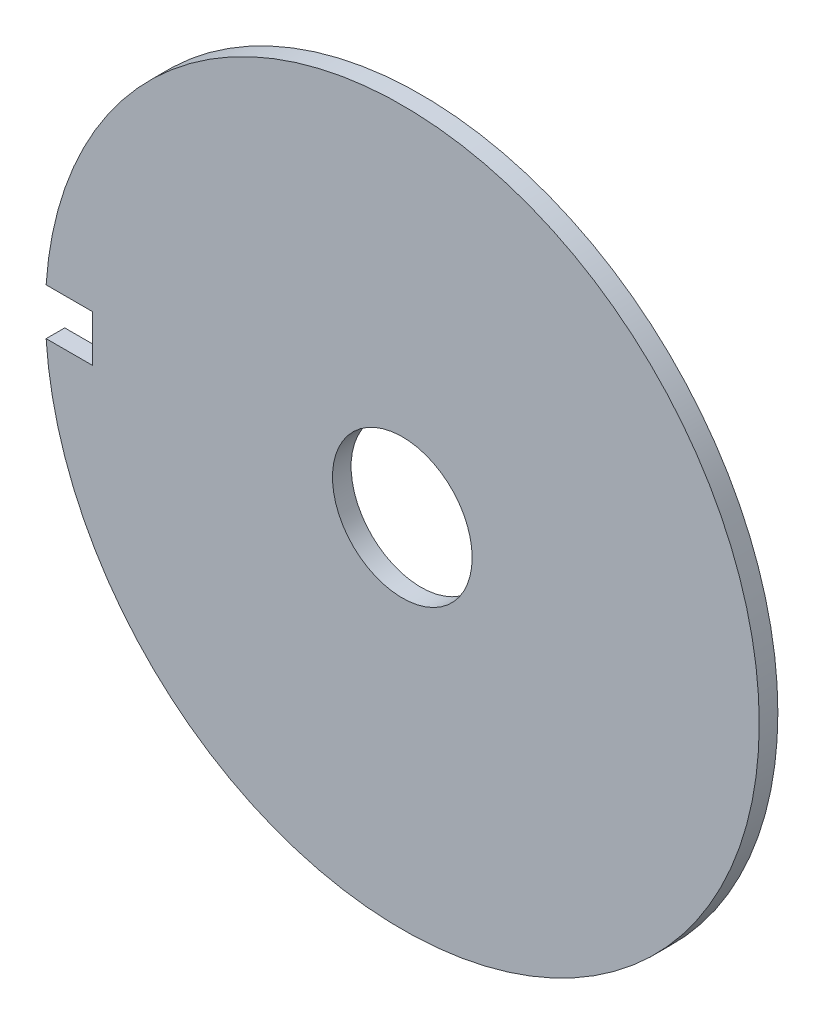
ISO-10303-21;
HEADER;
FILE_DESCRIPTION(('STEP AP214'),'2;1');
FILE_NAME('part.step','',(''),(''),'','','');
FILE_SCHEMA(('AUTOMOTIVE_DESIGN { 1 0 10303 214 1 1 1 1 }'));
ENDSEC;
DATA;
#1=APPLICATION_CONTEXT('core data for automotive mechanical design processes');
#2=APPLICATION_PROTOCOL_DEFINITION('international standard','automotive_design',2000,#1);
#3=PRODUCT_CONTEXT('',#1,'mechanical');
#4=PRODUCT('Part','Part','',(#3));
#5=PRODUCT_RELATED_PRODUCT_CATEGORY('part','',(#4));
#6=PRODUCT_DEFINITION_FORMATION('','',#4);
#7=PRODUCT_DEFINITION_CONTEXT('part definition',#1,'design');
#8=PRODUCT_DEFINITION('design','',#6,#7);
#9=PRODUCT_DEFINITION_SHAPE('','',#8);
#10=(LENGTH_UNIT() NAMED_UNIT(*) SI_UNIT(.MILLI.,.METRE.));
#11=(NAMED_UNIT(*) PLANE_ANGLE_UNIT() SI_UNIT($,.RADIAN.));
#12=(NAMED_UNIT(*) SI_UNIT($,.STERADIAN.) SOLID_ANGLE_UNIT());
#13=UNCERTAINTY_MEASURE_WITH_UNIT(LENGTH_MEASURE(1.E-05),#10,'distance_accuracy_value','');
#14=(GEOMETRIC_REPRESENTATION_CONTEXT(3) GLOBAL_UNCERTAINTY_ASSIGNED_CONTEXT((#13)) GLOBAL_UNIT_ASSIGNED_CONTEXT((#10,
#11,#12)) REPRESENTATION_CONTEXT('',''));
#15=CARTESIAN_POINT('',(0.,0.,0.));
#16=DIRECTION('',(0.,0.,1.));
#17=DIRECTION('',(1.,0.,0.));
#18=AXIS2_PLACEMENT_3D('',#15,#16,#17);
#19=CARTESIAN_POINT('',(0.,0.,6.));
#20=DIRECTION('',(0.,0.,1.));
#21=DIRECTION('',(1.,0.,0.));
#22=AXIS2_PLACEMENT_3D('',#19,#20,#21);
#23=PLANE('',#22);
#24=DIRECTION('',(-1.,0.,0.));
#25=VECTOR('',#24,1.);
#26=CARTESIAN_POINT('',(-114.755174175285,7.5,6.));
#27=LINE('',#26,#25);
#28=CARTESIAN_POINT('',(-99.755174175285,7.5,6.));
#29=VERTEX_POINT('',#28);
#30=CARTESIAN_POINT('',(-114.755174175285,7.5,6.));
#31=VERTEX_POINT('',#30);
#32=EDGE_CURVE('E80',#29,#31,#27,.T.);
#33=ORIENTED_EDGE('',*,*,#32,.F.);
#34=DIRECTION('',(0.,1.,0.));
#35=VECTOR('',#34,1.);
#36=CARTESIAN_POINT('',(-99.755174175285,7.5,6.));
#37=LINE('',#36,#35);
#38=CARTESIAN_POINT('',(-99.755174175285,-7.5,6.));
#39=VERTEX_POINT('',#38);
#40=EDGE_CURVE('E104',#39,#29,#37,.T.);
#41=ORIENTED_EDGE('',*,*,#40,.F.);
#42=DIRECTION('',(1.,0.,0.));
#43=VECTOR('',#42,1.);
#44=CARTESIAN_POINT('',(-99.755174175285,-7.5,6.));
#45=LINE('',#44,#43);
#46=CARTESIAN_POINT('',(-114.755174175285,-7.5,6.));
#47=VERTEX_POINT('',#46);
#48=EDGE_CURVE('E86',#47,#39,#45,.T.);
#49=ORIENTED_EDGE('',*,*,#48,.F.);
#50=CARTESIAN_POINT('',(0.,0.,6.));
#51=DIRECTION('',(0.,0.,1.));
#52=DIRECTION('',(1.,0.,0.));
#53=AXIS2_PLACEMENT_3D('',#50,#51,#52);
#54=CIRCLE('',#53,115.);
#55=EDGE_CURVE('E12',#47,#31,#54,.T.);
#56=ORIENTED_EDGE('',*,*,#55,.T.);
#57=EDGE_LOOP('',(#33,#41,#49,#56));
#58=FACE_BOUND('',#57,.T.);
#59=CARTESIAN_POINT('',(0.,0.,6.));
#60=DIRECTION('',(0.,0.,1.));
#61=DIRECTION('',(1.,0.,0.));
#62=AXIS2_PLACEMENT_3D('',#59,#60,#61);
#63=CIRCLE('',#62,22.5);
#64=CARTESIAN_POINT('',(22.5,0.,6.));
#65=VERTEX_POINT('',#64);
#66=EDGE_CURVE('E114',#65,#65,#63,.T.);
#67=ORIENTED_EDGE('',*,*,#66,.F.);
#68=EDGE_LOOP('',(#67));
#69=FACE_BOUND('',#68,.T.);
#70=ADVANCED_FACE('F40',(#58,#69),#23,.T.);
#71=CARTESIAN_POINT('',(0.,0.,0.));
#72=DIRECTION('',(0.,0.,1.));
#73=DIRECTION('',(1.,0.,0.));
#74=AXIS2_PLACEMENT_3D('',#71,#72,#73);
#75=PLANE('',#74);
#76=DIRECTION('',(0.,1.,0.));
#77=VECTOR('',#76,1.);
#78=CARTESIAN_POINT('',(-99.755174175285,7.5,0.));
#79=LINE('',#78,#77);
#80=CARTESIAN_POINT('',(-99.755174175285,-7.5,0.));
#81=VERTEX_POINT('',#80);
#82=CARTESIAN_POINT('',(-99.755174175285,7.5,0.));
#83=VERTEX_POINT('',#82);
#84=EDGE_CURVE('E94',#81,#83,#79,.T.);
#85=ORIENTED_EDGE('',*,*,#84,.T.);
#86=DIRECTION('',(-1.,0.,0.));
#87=VECTOR('',#86,1.);
#88=CARTESIAN_POINT('',(-114.755174175285,7.5,0.));
#89=LINE('',#88,#87);
#90=CARTESIAN_POINT('',(-114.755174175285,7.5,0.));
#91=VERTEX_POINT('',#90);
#92=EDGE_CURVE('E97',#83,#91,#89,.T.);
#93=ORIENTED_EDGE('',*,*,#92,.T.);
#94=CARTESIAN_POINT('',(0.,0.,0.));
#95=DIRECTION('',(0.,0.,1.));
#96=DIRECTION('',(1.,0.,0.));
#97=AXIS2_PLACEMENT_3D('',#94,#95,#96);
#98=CIRCLE('',#97,115.);
#99=CARTESIAN_POINT('',(-114.755174175285,-7.49999999999999,0.));
#100=VERTEX_POINT('',#99);
#101=EDGE_CURVE('E44',#100,#91,#98,.T.);
#102=ORIENTED_EDGE('',*,*,#101,.F.);
#103=DIRECTION('',(1.,0.,0.));
#104=VECTOR('',#103,1.);
#105=CARTESIAN_POINT('',(-99.755174175285,-7.5,0.));
#106=LINE('',#105,#104);
#107=EDGE_CURVE('E55',#100,#81,#106,.T.);
#108=ORIENTED_EDGE('',*,*,#107,.T.);
#109=EDGE_LOOP('',(#85,#93,#102,#108));
#110=FACE_BOUND('',#109,.T.);
#111=CARTESIAN_POINT('',(0.,0.,0.));
#112=DIRECTION('',(0.,0.,1.));
#113=DIRECTION('',(1.,0.,0.));
#114=AXIS2_PLACEMENT_3D('',#111,#112,#113);
#115=CIRCLE('',#114,22.5);
#116=CARTESIAN_POINT('',(22.5,0.,0.));
#117=VERTEX_POINT('',#116);
#118=EDGE_CURVE('E111',#117,#117,#115,.T.);
#119=ORIENTED_EDGE('',*,*,#118,.T.);
#120=EDGE_LOOP('',(#119));
#121=FACE_BOUND('',#120,.T.);
#122=ADVANCED_FACE('F100',(#110,#121),#75,.F.);
#123=CARTESIAN_POINT('',(0.,0.,6.));
#124=DIRECTION('',(0.,0.,-1.));
#125=DIRECTION('',(-1.,0.,0.));
#126=AXIS2_PLACEMENT_3D('',#123,#124,#125);
#127=CYLINDRICAL_SURFACE('',#126,115.);
#128=ORIENTED_EDGE('',*,*,#101,.T.);
#129=DIRECTION('',(0.,0.,1.));
#130=VECTOR('',#129,1.);
#131=CARTESIAN_POINT('',(-114.755174175285,7.5,0.));
#132=LINE('',#131,#130);
#133=EDGE_CURVE('E64',#91,#31,#132,.T.);
#134=ORIENTED_EDGE('',*,*,#133,.T.);
#135=ORIENTED_EDGE('',*,*,#55,.F.);
#136=DIRECTION('',(0.,0.,1.));
#137=VECTOR('',#136,1.);
#138=CARTESIAN_POINT('',(-114.755174175285,-7.5,0.));
#139=LINE('',#138,#137);
#140=EDGE_CURVE('E91',#100,#47,#139,.T.);
#141=ORIENTED_EDGE('',*,*,#140,.F.);
#142=EDGE_LOOP('',(#128,#134,#135,#141));
#143=FACE_BOUND('',#142,.T.);
#144=ADVANCED_FACE('F42',(#143),#127,.T.);
#145=CARTESIAN_POINT('',(0.,0.,6.));
#146=DIRECTION('',(0.,0.,-1.));
#147=DIRECTION('',(-1.,0.,0.));
#148=AXIS2_PLACEMENT_3D('',#145,#146,#147);
#149=CYLINDRICAL_SURFACE('',#148,22.5);
#150=ORIENTED_EDGE('',*,*,#66,.T.);
#151=EDGE_LOOP('',(#150));
#152=FACE_BOUND('',#151,.T.);
#153=ORIENTED_EDGE('',*,*,#118,.F.);
#154=EDGE_LOOP('',(#153));
#155=FACE_BOUND('',#154,.T.);
#156=ADVANCED_FACE('F120',(#152,#155),#149,.F.);
#157=CARTESIAN_POINT('',(-114.755174175285,7.5,0.));
#158=DIRECTION('',(0.,1.,0.));
#159=DIRECTION('',(0.,0.,1.));
#160=AXIS2_PLACEMENT_3D('',#157,#158,#159);
#161=PLANE('',#160);
#162=ORIENTED_EDGE('',*,*,#32,.T.);
#163=ORIENTED_EDGE('',*,*,#133,.F.);
#164=ORIENTED_EDGE('',*,*,#92,.F.);
#165=DIRECTION('',(0.,0.,1.));
#166=VECTOR('',#165,1.);
#167=CARTESIAN_POINT('',(-99.755174175285,7.5,0.));
#168=LINE('',#167,#166);
#169=EDGE_CURVE('E90',#83,#29,#168,.T.);
#170=ORIENTED_EDGE('',*,*,#169,.T.);
#171=EDGE_LOOP('',(#162,#163,#164,#170));
#172=FACE_BOUND('',#171,.T.);
#173=ADVANCED_FACE('F122',(#172),#161,.F.);
#174=CARTESIAN_POINT('',(-99.755174175285,7.5,0.));
#175=DIRECTION('',(1.,0.,0.));
#176=DIRECTION('',(0.,0.,-1.));
#177=AXIS2_PLACEMENT_3D('',#174,#175,#176);
#178=PLANE('',#177);
#179=ORIENTED_EDGE('',*,*,#40,.T.);
#180=ORIENTED_EDGE('',*,*,#169,.F.);
#181=ORIENTED_EDGE('',*,*,#84,.F.);
#182=DIRECTION('',(0.,0.,1.));
#183=VECTOR('',#182,1.);
#184=CARTESIAN_POINT('',(-99.755174175285,-7.5,0.));
#185=LINE('',#184,#183);
#186=EDGE_CURVE('E82',#81,#39,#185,.T.);
#187=ORIENTED_EDGE('',*,*,#186,.T.);
#188=EDGE_LOOP('',(#179,#180,#181,#187));
#189=FACE_BOUND('',#188,.T.);
#190=ADVANCED_FACE('F95',(#189),#178,.F.);
#191=CARTESIAN_POINT('',(-99.755174175285,-7.5,0.));
#192=DIRECTION('',(0.,-1.,0.));
#193=DIRECTION('',(1.,0.,0.));
#194=AXIS2_PLACEMENT_3D('',#191,#192,#193);
#195=PLANE('',#194);
#196=ORIENTED_EDGE('',*,*,#48,.T.);
#197=ORIENTED_EDGE('',*,*,#186,.F.);
#198=ORIENTED_EDGE('',*,*,#107,.F.);
#199=ORIENTED_EDGE('',*,*,#140,.T.);
#200=EDGE_LOOP('',(#196,#197,#198,#199));
#201=FACE_BOUND('',#200,.T.);
#202=ADVANCED_FACE('F84',(#201),#195,.F.);
#203=CLOSED_SHELL('',(#70,#122,#144,#156,#173,#190,#202));
#204=MANIFOLD_SOLID_BREP('B2',#203);
#205=ADVANCED_BREP_SHAPE_REPRESENTATION('',(#18,#204),#14);
#206=SHAPE_DEFINITION_REPRESENTATION(#9,#205);
ENDSEC;
END-ISO-10303-21;
